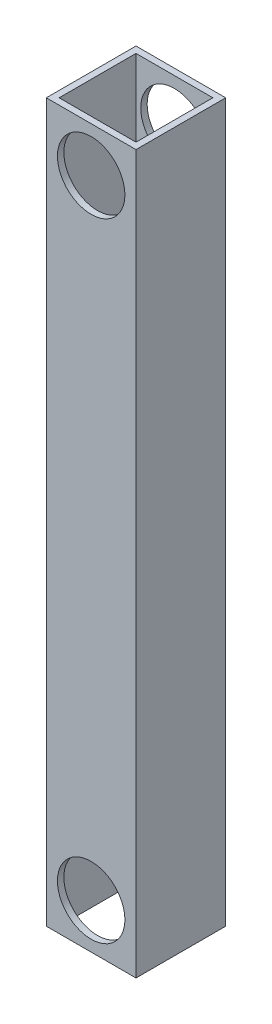
ISO-10303-21;
HEADER;
FILE_DESCRIPTION(('STEP AP214'),'2;1');
FILE_NAME('part.step','',(''),(''),'','','');
FILE_SCHEMA(('AUTOMOTIVE_DESIGN { 1 0 10303 214 1 1 1 1 }'));
ENDSEC;
DATA;
#1=APPLICATION_CONTEXT('core data for automotive mechanical design processes');
#2=APPLICATION_PROTOCOL_DEFINITION('international standard','automotive_design',2000,#1);
#3=PRODUCT_CONTEXT('',#1,'mechanical');
#4=PRODUCT('Part','Part','',(#3));
#5=PRODUCT_RELATED_PRODUCT_CATEGORY('part','',(#4));
#6=PRODUCT_DEFINITION_FORMATION('','',#4);
#7=PRODUCT_DEFINITION_CONTEXT('part definition',#1,'design');
#8=PRODUCT_DEFINITION('design','',#6,#7);
#9=PRODUCT_DEFINITION_SHAPE('','',#8);
#10=(LENGTH_UNIT() NAMED_UNIT(*) SI_UNIT(.MILLI.,.METRE.));
#11=(NAMED_UNIT(*) PLANE_ANGLE_UNIT() SI_UNIT($,.RADIAN.));
#12=(NAMED_UNIT(*) SI_UNIT($,.STERADIAN.) SOLID_ANGLE_UNIT());
#13=UNCERTAINTY_MEASURE_WITH_UNIT(LENGTH_MEASURE(1.E-05),#10,'distance_accuracy_value','');
#14=(GEOMETRIC_REPRESENTATION_CONTEXT(3) GLOBAL_UNCERTAINTY_ASSIGNED_CONTEXT((#13)) GLOBAL_UNIT_ASSIGNED_CONTEXT((#10,
#11,#12)) REPRESENTATION_CONTEXT('',''));
#15=CARTESIAN_POINT('',(0.,0.,0.));
#16=DIRECTION('',(0.,0.,1.));
#17=DIRECTION('',(1.,0.,0.));
#18=AXIS2_PLACEMENT_3D('',#15,#16,#17);
#19=CARTESIAN_POINT('',(-587.375,0.,-6.35));
#20=DIRECTION('',(0.,0.,-1.));
#21=DIRECTION('',(-1.,0.,0.));
#22=AXIS2_PLACEMENT_3D('',#19,#20,#21);
#23=CYLINDRICAL_SURFACE('',#22,16.7005);
#24=CARTESIAN_POINT('',(-587.375,0.,0.));
#25=DIRECTION('',(0.,0.,-1.));
#26=DIRECTION('',(-1.,0.,0.));
#27=AXIS2_PLACEMENT_3D('',#24,#25,#26);
#28=CIRCLE('',#27,16.7005);
#29=CARTESIAN_POINT('',(-604.0755,0.,0.));
#30=VERTEX_POINT('',#29);
#31=EDGE_CURVE('E127',#30,#30,#28,.F.);
#32=ORIENTED_EDGE('',*,*,#31,.F.);
#33=EDGE_LOOP('',(#32));
#34=FACE_BOUND('',#33,.T.);
#35=CARTESIAN_POINT('',(-587.375,0.,3.17500000000013));
#36=DIRECTION('',(0.,0.,-1.));
#37=DIRECTION('',(-1.,0.,0.));
#38=AXIS2_PLACEMENT_3D('',#35,#36,#37);
#39=CIRCLE('',#38,16.7005);
#40=CARTESIAN_POINT('',(-604.0755,0.,3.17500000000013));
#41=VERTEX_POINT('',#40);
#42=EDGE_CURVE('E17',#41,#41,#39,.F.);
#43=ORIENTED_EDGE('',*,*,#42,.T.);
#44=EDGE_LOOP('',(#43));
#45=FACE_BOUND('',#44,.T.);
#46=ADVANCED_FACE('F14',(#34,#45),#23,.F.);
#47=CARTESIAN_POINT('',(-587.375,311.15,-6.35));
#48=DIRECTION('',(0.,0.,-1.));
#49=DIRECTION('',(-1.,0.,0.));
#50=AXIS2_PLACEMENT_3D('',#47,#48,#49);
#51=CYLINDRICAL_SURFACE('',#50,16.7005);
#52=CARTESIAN_POINT('',(-587.375,311.15,0.));
#53=DIRECTION('',(0.,0.,-1.));
#54=DIRECTION('',(-1.,0.,0.));
#55=AXIS2_PLACEMENT_3D('',#52,#53,#54);
#56=CIRCLE('',#55,16.7005);
#57=CARTESIAN_POINT('',(-604.0755,311.15,0.));
#58=VERTEX_POINT('',#57);
#59=EDGE_CURVE('E108',#58,#58,#56,.F.);
#60=ORIENTED_EDGE('',*,*,#59,.F.);
#61=EDGE_LOOP('',(#60));
#62=FACE_BOUND('',#61,.T.);
#63=CARTESIAN_POINT('',(-587.375,311.15,3.17500000000004));
#64=DIRECTION('',(0.,0.,-1.));
#65=DIRECTION('',(-1.,0.,0.));
#66=AXIS2_PLACEMENT_3D('',#63,#64,#65);
#67=CIRCLE('',#66,16.7005);
#68=CARTESIAN_POINT('',(-604.0755,311.15,3.17500000000004));
#69=VERTEX_POINT('',#68);
#70=EDGE_CURVE('E114',#69,#69,#67,.F.);
#71=ORIENTED_EDGE('',*,*,#70,.T.);
#72=EDGE_LOOP('',(#71));
#73=FACE_BOUND('',#72,.T.);
#74=ADVANCED_FACE('F205',(#62,#73),#51,.F.);
#75=CARTESIAN_POINT('',(-587.375,0.,-6.35));
#76=DIRECTION('',(0.,0.,-1.));
#77=DIRECTION('',(-1.,0.,0.));
#78=AXIS2_PLACEMENT_3D('',#75,#76,#77);
#79=CYLINDRICAL_SURFACE('',#78,16.7005);
#80=CARTESIAN_POINT('',(-587.375,0.,44.45));
#81=DIRECTION('',(0.,0.,-1.));
#82=DIRECTION('',(-1.,0.,0.));
#83=AXIS2_PLACEMENT_3D('',#80,#81,#82);
#84=CIRCLE('',#83,16.7005);
#85=CARTESIAN_POINT('',(-604.0755,0.,44.45));
#86=VERTEX_POINT('',#85);
#87=EDGE_CURVE('E121',#86,#86,#84,.F.);
#88=ORIENTED_EDGE('',*,*,#87,.T.);
#89=EDGE_LOOP('',(#88));
#90=FACE_BOUND('',#89,.T.);
#91=CARTESIAN_POINT('',(-587.375,0.,41.275));
#92=DIRECTION('',(0.,0.,-1.));
#93=DIRECTION('',(-1.,0.,0.));
#94=AXIS2_PLACEMENT_3D('',#91,#92,#93);
#95=CIRCLE('',#94,16.7005);
#96=CARTESIAN_POINT('',(-604.0755,0.,41.275));
#97=VERTEX_POINT('',#96);
#98=EDGE_CURVE('E92',#97,#97,#95,.T.);
#99=ORIENTED_EDGE('',*,*,#98,.T.);
#100=EDGE_LOOP('',(#99));
#101=FACE_BOUND('',#100,.T.);
#102=ADVANCED_FACE('F210',(#90,#101),#79,.F.);
#103=CARTESIAN_POINT('',(-587.375,311.15,-6.35));
#104=DIRECTION('',(0.,0.,-1.));
#105=DIRECTION('',(-1.,0.,0.));
#106=AXIS2_PLACEMENT_3D('',#103,#104,#105);
#107=CYLINDRICAL_SURFACE('',#106,16.7005);
#108=CARTESIAN_POINT('',(-587.375,311.15,44.45));
#109=DIRECTION('',(0.,0.,-1.));
#110=DIRECTION('',(-1.,0.,0.));
#111=AXIS2_PLACEMENT_3D('',#108,#109,#110);
#112=CIRCLE('',#111,16.7005);
#113=CARTESIAN_POINT('',(-604.0755,311.15,44.45));
#114=VERTEX_POINT('',#113);
#115=EDGE_CURVE('E117',#114,#114,#112,.F.);
#116=ORIENTED_EDGE('',*,*,#115,.T.);
#117=EDGE_LOOP('',(#116));
#118=FACE_BOUND('',#117,.T.);
#119=CARTESIAN_POINT('',(-587.375,311.15,41.275));
#120=DIRECTION('',(0.,0.,-1.));
#121=DIRECTION('',(-1.,0.,0.));
#122=AXIS2_PLACEMENT_3D('',#119,#120,#121);
#123=CIRCLE('',#122,16.7005);
#124=CARTESIAN_POINT('',(-604.0755,311.15,41.275));
#125=VERTEX_POINT('',#124);
#126=EDGE_CURVE('E130',#125,#125,#123,.T.);
#127=ORIENTED_EDGE('',*,*,#126,.T.);
#128=EDGE_LOOP('',(#127));
#129=FACE_BOUND('',#128,.T.);
#130=ADVANCED_FACE('F232',(#118,#129),#107,.F.);
#131=CARTESIAN_POINT('',(-568.325,-937.412636921582,25.4));
#132=DIRECTION('',(1.,0.,0.));
#133=DIRECTION('',(0.,0.,-1.));
#134=AXIS2_PLACEMENT_3D('',#131,#132,#133);
#135=PLANE('',#134);
#136=DIRECTION('',(0.,-1.,0.));
#137=VECTOR('',#136,1.);
#138=CARTESIAN_POINT('',(-568.325,-937.412636921582,41.275));
#139=LINE('',#138,#137);
#140=CARTESIAN_POINT('',(-568.325,-22.225,41.2749999999999));
#141=VERTEX_POINT('',#140);
#142=CARTESIAN_POINT('',(-568.325,333.375,41.2749999999999));
#143=VERTEX_POINT('',#142);
#144=EDGE_CURVE('E93',#141,#143,#139,.F.);
#145=ORIENTED_EDGE('',*,*,#144,.T.);
#146=DIRECTION('',(0.,0.,-1.));
#147=VECTOR('',#146,1.);
#148=CARTESIAN_POINT('',(-568.325,333.375,25.4));
#149=LINE('',#148,#147);
#150=CARTESIAN_POINT('',(-568.325,333.375,3.17500000000009));
#151=VERTEX_POINT('',#150);
#152=EDGE_CURVE('E153',#143,#151,#149,.T.);
#153=ORIENTED_EDGE('',*,*,#152,.T.);
#154=DIRECTION('',(0.,1.,0.));
#155=VECTOR('',#154,1.);
#156=CARTESIAN_POINT('',(-568.325,-937.412636921582,3.17500000000043));
#157=LINE('',#156,#155);
#158=CARTESIAN_POINT('',(-568.325,-22.225,3.17500000000015));
#159=VERTEX_POINT('',#158);
#160=EDGE_CURVE('E115',#151,#159,#157,.F.);
#161=ORIENTED_EDGE('',*,*,#160,.T.);
#162=DIRECTION('',(0.,0.,-1.));
#163=VECTOR('',#162,1.);
#164=CARTESIAN_POINT('',(-568.325,-22.225,44.45));
#165=LINE('',#164,#163);
#166=EDGE_CURVE('E101',#141,#159,#165,.T.);
#167=ORIENTED_EDGE('',*,*,#166,.F.);
#168=EDGE_LOOP('',(#145,#153,#161,#167));
#169=FACE_BOUND('',#168,.T.);
#170=ADVANCED_FACE('F143',(#169),#135,.F.);
#171=CARTESIAN_POINT('',(-609.6,-937.412636921582,3.17500000000043));
#172=DIRECTION('',(0.,0.,-1.));
#173=DIRECTION('',(0.,1.,0.));
#174=AXIS2_PLACEMENT_3D('',#171,#172,#173);
#175=PLANE('',#174);
#176=ORIENTED_EDGE('',*,*,#70,.F.);
#177=EDGE_LOOP('',(#176));
#178=FACE_BOUND('',#177,.T.);
#179=ORIENTED_EDGE('',*,*,#42,.F.);
#180=EDGE_LOOP('',(#179));
#181=FACE_BOUND('',#180,.T.);
#182=ORIENTED_EDGE('',*,*,#160,.F.);
#183=DIRECTION('',(1.,0.,0.));
#184=VECTOR('',#183,1.);
#185=CARTESIAN_POINT('',(-609.6,333.375,3.17500000000004));
#186=LINE('',#185,#184);
#187=CARTESIAN_POINT('',(-606.425,333.375,3.17500000000004));
#188=VERTEX_POINT('',#187);
#189=EDGE_CURVE('E148',#151,#188,#186,.F.);
#190=ORIENTED_EDGE('',*,*,#189,.T.);
#191=DIRECTION('',(0.,1.,0.));
#192=VECTOR('',#191,1.);
#193=CARTESIAN_POINT('',(-606.425,-937.412636921582,3.17500000000004));
#194=LINE('',#193,#192);
#195=CARTESIAN_POINT('',(-606.425,-22.225,3.17500000000009));
#196=VERTEX_POINT('',#195);
#197=EDGE_CURVE('E76',#188,#196,#194,.F.);
#198=ORIENTED_EDGE('',*,*,#197,.T.);
#199=DIRECTION('',(1.,0.,0.));
#200=VECTOR('',#199,1.);
#201=CARTESIAN_POINT('',(-609.6,-22.225,3.17500000000015));
#202=LINE('',#201,#200);
#203=EDGE_CURVE('E104',#159,#196,#202,.F.);
#204=ORIENTED_EDGE('',*,*,#203,.F.);
#205=EDGE_LOOP('',(#182,#190,#198,#204));
#206=FACE_BOUND('',#205,.T.);
#207=ADVANCED_FACE('F141',(#178,#181,#206),#175,.F.);
#208=CARTESIAN_POINT('',(-606.425,-937.412636921582,25.4));
#209=DIRECTION('',(-1.,0.,0.));
#210=DIRECTION('',(0.,0.,1.));
#211=AXIS2_PLACEMENT_3D('',#208,#209,#210);
#212=PLANE('',#211);
#213=ORIENTED_EDGE('',*,*,#197,.F.);
#214=DIRECTION('',(0.,0.,-1.));
#215=VECTOR('',#214,1.);
#216=CARTESIAN_POINT('',(-606.425,333.375,25.4));
#217=LINE('',#216,#215);
#218=CARTESIAN_POINT('',(-606.425,333.375,41.2749999999999));
#219=VERTEX_POINT('',#218);
#220=EDGE_CURVE('E88',#188,#219,#217,.F.);
#221=ORIENTED_EDGE('',*,*,#220,.T.);
#222=DIRECTION('',(0.,-1.,0.));
#223=VECTOR('',#222,1.);
#224=CARTESIAN_POINT('',(-606.425,-937.412636921582,41.275));
#225=LINE('',#224,#223);
#226=CARTESIAN_POINT('',(-606.425,-22.225,41.2749999999999));
#227=VERTEX_POINT('',#226);
#228=EDGE_CURVE('E81',#219,#227,#225,.T.);
#229=ORIENTED_EDGE('',*,*,#228,.T.);
#230=DIRECTION('',(0.,0.,-1.));
#231=VECTOR('',#230,1.);
#232=CARTESIAN_POINT('',(-606.425,-22.225,44.45));
#233=LINE('',#232,#231);
#234=EDGE_CURVE('E85',#196,#227,#233,.F.);
#235=ORIENTED_EDGE('',*,*,#234,.F.);
#236=EDGE_LOOP('',(#213,#221,#229,#235));
#237=FACE_BOUND('',#236,.T.);
#238=ADVANCED_FACE('F83',(#237),#212,.F.);
#239=CARTESIAN_POINT('',(-609.6,-937.412636921582,41.275));
#240=DIRECTION('',(0.,0.,1.));
#241=DIRECTION('',(0.,-1.,0.));
#242=AXIS2_PLACEMENT_3D('',#239,#240,#241);
#243=PLANE('',#242);
#244=ORIENTED_EDGE('',*,*,#126,.F.);
#245=EDGE_LOOP('',(#244));
#246=FACE_BOUND('',#245,.T.);
#247=ORIENTED_EDGE('',*,*,#98,.F.);
#248=EDGE_LOOP('',(#247));
#249=FACE_BOUND('',#248,.T.);
#250=ORIENTED_EDGE('',*,*,#228,.F.);
#251=DIRECTION('',(1.,0.,0.));
#252=VECTOR('',#251,1.);
#253=CARTESIAN_POINT('',(-609.6,333.375,41.275));
#254=LINE('',#253,#252);
#255=EDGE_CURVE('E155',#219,#143,#254,.T.);
#256=ORIENTED_EDGE('',*,*,#255,.T.);
#257=ORIENTED_EDGE('',*,*,#144,.F.);
#258=DIRECTION('',(1.,0.,0.));
#259=VECTOR('',#258,1.);
#260=CARTESIAN_POINT('',(-609.6,-22.225,41.275));
#261=LINE('',#260,#259);
#262=EDGE_CURVE('E96',#227,#141,#261,.T.);
#263=ORIENTED_EDGE('',*,*,#262,.F.);
#264=EDGE_LOOP('',(#250,#256,#257,#263));
#265=FACE_BOUND('',#264,.T.);
#266=ADVANCED_FACE('F97',(#246,#249,#265),#243,.F.);
#267=CARTESIAN_POINT('',(-565.15,155.575,22.225));
#268=DIRECTION('',(-1.,0.,0.));
#269=DIRECTION('',(0.,0.,1.));
#270=AXIS2_PLACEMENT_3D('',#267,#268,#269);
#271=PLANE('',#270);
#272=DIRECTION('',(0.,0.,-1.));
#273=VECTOR('',#272,1.);
#274=CARTESIAN_POINT('',(-565.15,333.375,25.4));
#275=LINE('',#274,#273);
#276=CARTESIAN_POINT('',(-565.15,333.375,0.));
#277=VERTEX_POINT('',#276);
#278=CARTESIAN_POINT('',(-565.15,333.375,44.45));
#279=VERTEX_POINT('',#278);
#280=EDGE_CURVE('E173',#277,#279,#275,.F.);
#281=ORIENTED_EDGE('',*,*,#280,.T.);
#282=DIRECTION('',(0.,1.,0.));
#283=VECTOR('',#282,1.);
#284=CARTESIAN_POINT('',(-565.15,42.4473088562489,44.45));
#285=LINE('',#284,#283);
#286=CARTESIAN_POINT('',(-565.15,-22.225,44.45));
#287=VERTEX_POINT('',#286);
#288=EDGE_CURVE('E157',#279,#287,#285,.F.);
#289=ORIENTED_EDGE('',*,*,#288,.T.);
#290=DIRECTION('',(0.,0.,-1.));
#291=VECTOR('',#290,1.);
#292=CARTESIAN_POINT('',(-565.15,-22.225,44.45));
#293=LINE('',#292,#291);
#294=CARTESIAN_POINT('',(-565.15,-22.225,0.));
#295=VERTEX_POINT('',#294);
#296=EDGE_CURVE('E166',#295,#287,#293,.F.);
#297=ORIENTED_EDGE('',*,*,#296,.F.);
#298=DIRECTION('',(0.,1.,0.));
#299=VECTOR('',#298,1.);
#300=CARTESIAN_POINT('',(-565.15,45.6223088562488,0.));
#301=LINE('',#300,#299);
#302=EDGE_CURVE('E105',#277,#295,#301,.F.);
#303=ORIENTED_EDGE('',*,*,#302,.F.);
#304=EDGE_LOOP('',(#281,#289,#297,#303));
#305=FACE_BOUND('',#304,.T.);
#306=ADVANCED_FACE('F191',(#305),#271,.F.);
#307=CARTESIAN_POINT('',(-609.6,45.6223088562488,0.));
#308=DIRECTION('',(0.,0.,-1.));
#309=DIRECTION('',(-1.,0.,0.));
#310=AXIS2_PLACEMENT_3D('',#307,#308,#309);
#311=PLANE('',#310);
#312=DIRECTION('',(0.,1.,0.));
#313=VECTOR('',#312,1.);
#314=CARTESIAN_POINT('',(-609.6,155.575,0.));
#315=LINE('',#314,#313);
#316=CARTESIAN_POINT('',(-609.6,333.375,0.));
#317=VERTEX_POINT('',#316);
#318=CARTESIAN_POINT('',(-609.6,-22.225,0.));
#319=VERTEX_POINT('',#318);
#320=EDGE_CURVE('E176',#317,#319,#315,.F.);
#321=ORIENTED_EDGE('',*,*,#320,.F.);
#322=DIRECTION('',(1.,0.,0.));
#323=VECTOR('',#322,1.);
#324=CARTESIAN_POINT('',(-609.6,333.375,0.));
#325=LINE('',#324,#323);
#326=EDGE_CURVE('E168',#317,#277,#325,.T.);
#327=ORIENTED_EDGE('',*,*,#326,.T.);
#328=ORIENTED_EDGE('',*,*,#302,.T.);
#329=DIRECTION('',(1.,0.,0.));
#330=VECTOR('',#329,1.);
#331=CARTESIAN_POINT('',(-609.6,-22.225,0.));
#332=LINE('',#331,#330);
#333=EDGE_CURVE('E124',#319,#295,#332,.T.);
#334=ORIENTED_EDGE('',*,*,#333,.F.);
#335=EDGE_LOOP('',(#321,#327,#328,#334));
#336=FACE_BOUND('',#335,.T.);
#337=ORIENTED_EDGE('',*,*,#59,.T.);
#338=EDGE_LOOP('',(#337));
#339=FACE_BOUND('',#338,.T.);
#340=ORIENTED_EDGE('',*,*,#31,.T.);
#341=EDGE_LOOP('',(#340));
#342=FACE_BOUND('',#341,.T.);
#343=ADVANCED_FACE('F196',(#336,#339,#342),#311,.T.);
#344=CARTESIAN_POINT('',(-609.6,-22.225,44.45));
#345=DIRECTION('',(0.,-1.,0.));
#346=DIRECTION('',(0.,0.,-1.));
#347=AXIS2_PLACEMENT_3D('',#344,#345,#346);
#348=PLANE('',#347);
#349=DIRECTION('',(0.,0.,1.));
#350=VECTOR('',#349,1.);
#351=CARTESIAN_POINT('',(-609.6,-22.225,22.225));
#352=LINE('',#351,#350);
#353=CARTESIAN_POINT('',(-609.6,-22.225,44.45));
#354=VERTEX_POINT('',#353);
#355=EDGE_CURVE('E179',#319,#354,#352,.T.);
#356=ORIENTED_EDGE('',*,*,#355,.F.);
#357=ORIENTED_EDGE('',*,*,#333,.T.);
#358=ORIENTED_EDGE('',*,*,#296,.T.);
#359=DIRECTION('',(1.,0.,0.));
#360=VECTOR('',#359,1.);
#361=CARTESIAN_POINT('',(-609.6,-22.225,44.45));
#362=LINE('',#361,#360);
#363=EDGE_CURVE('E120',#287,#354,#362,.F.);
#364=ORIENTED_EDGE('',*,*,#363,.T.);
#365=EDGE_LOOP('',(#356,#357,#358,#364));
#366=FACE_BOUND('',#365,.T.);
#367=ORIENTED_EDGE('',*,*,#166,.T.);
#368=ORIENTED_EDGE('',*,*,#203,.T.);
#369=ORIENTED_EDGE('',*,*,#234,.T.);
#370=ORIENTED_EDGE('',*,*,#262,.T.);
#371=EDGE_LOOP('',(#367,#368,#369,#370));
#372=FACE_BOUND('',#371,.T.);
#373=ADVANCED_FACE('F103',(#366,#372),#348,.T.);
#374=CARTESIAN_POINT('',(-609.6,42.4473088562489,44.45));
#375=DIRECTION('',(0.,0.,-1.));
#376=DIRECTION('',(0.,1.,0.));
#377=AXIS2_PLACEMENT_3D('',#374,#375,#376);
#378=PLANE('',#377);
#379=DIRECTION('',(1.,0.,0.));
#380=VECTOR('',#379,1.);
#381=CARTESIAN_POINT('',(-609.6,333.375,44.45));
#382=LINE('',#381,#380);
#383=CARTESIAN_POINT('',(-609.6,333.375,44.45));
#384=VERTEX_POINT('',#383);
#385=EDGE_CURVE('E32',#279,#384,#382,.F.);
#386=ORIENTED_EDGE('',*,*,#385,.T.);
#387=DIRECTION('',(0.,1.,0.));
#388=VECTOR('',#387,1.);
#389=CARTESIAN_POINT('',(-609.6,155.575,44.45));
#390=LINE('',#389,#388);
#391=EDGE_CURVE('E23',#354,#384,#390,.T.);
#392=ORIENTED_EDGE('',*,*,#391,.F.);
#393=ORIENTED_EDGE('',*,*,#363,.F.);
#394=ORIENTED_EDGE('',*,*,#288,.F.);
#395=EDGE_LOOP('',(#386,#392,#393,#394));
#396=FACE_BOUND('',#395,.T.);
#397=ORIENTED_EDGE('',*,*,#115,.F.);
#398=EDGE_LOOP('',(#397));
#399=FACE_BOUND('',#398,.T.);
#400=ORIENTED_EDGE('',*,*,#87,.F.);
#401=EDGE_LOOP('',(#400));
#402=FACE_BOUND('',#401,.T.);
#403=ADVANCED_FACE('F187',(#396,#399,#402),#378,.F.);
#404=CARTESIAN_POINT('',(-609.6,333.375,25.4));
#405=DIRECTION('',(0.,-1.,0.));
#406=DIRECTION('',(0.,0.,-1.));
#407=AXIS2_PLACEMENT_3D('',#404,#405,#406);
#408=PLANE('',#407);
#409=ORIENTED_EDGE('',*,*,#326,.F.);
#410=DIRECTION('',(0.,0.,1.));
#411=VECTOR('',#410,1.);
#412=CARTESIAN_POINT('',(-609.6,333.375,22.225));
#413=LINE('',#412,#411);
#414=EDGE_CURVE('E9',#384,#317,#413,.F.);
#415=ORIENTED_EDGE('',*,*,#414,.F.);
#416=ORIENTED_EDGE('',*,*,#385,.F.);
#417=ORIENTED_EDGE('',*,*,#280,.F.);
#418=EDGE_LOOP('',(#409,#415,#416,#417));
#419=FACE_BOUND('',#418,.T.);
#420=ORIENTED_EDGE('',*,*,#220,.F.);
#421=ORIENTED_EDGE('',*,*,#189,.F.);
#422=ORIENTED_EDGE('',*,*,#152,.F.);
#423=ORIENTED_EDGE('',*,*,#255,.F.);
#424=EDGE_LOOP('',(#420,#421,#422,#423));
#425=FACE_BOUND('',#424,.T.);
#426=ADVANCED_FACE('F152',(#419,#425),#408,.F.);
#427=CARTESIAN_POINT('',(-609.6,155.575,22.225));
#428=DIRECTION('',(-1.,0.,0.));
#429=DIRECTION('',(0.,0.,1.));
#430=AXIS2_PLACEMENT_3D('',#427,#428,#429);
#431=PLANE('',#430);
#432=ORIENTED_EDGE('',*,*,#391,.T.);
#433=ORIENTED_EDGE('',*,*,#414,.T.);
#434=ORIENTED_EDGE('',*,*,#320,.T.);
#435=ORIENTED_EDGE('',*,*,#355,.T.);
#436=EDGE_LOOP('',(#432,#433,#434,#435));
#437=FACE_BOUND('',#436,.T.);
#438=ADVANCED_FACE('F184',(#437),#431,.T.);
#439=CLOSED_SHELL('',(#46,#74,#102,#130,#170,#207,#238,#266,#306,#343,#373,#403,#426,#438));
#440=MANIFOLD_SOLID_BREP('B1',#439);
#441=ADVANCED_BREP_SHAPE_REPRESENTATION('',(#18,#440),#14);
#442=SHAPE_DEFINITION_REPRESENTATION(#9,#441);
ENDSEC;
END-ISO-10303-21;
